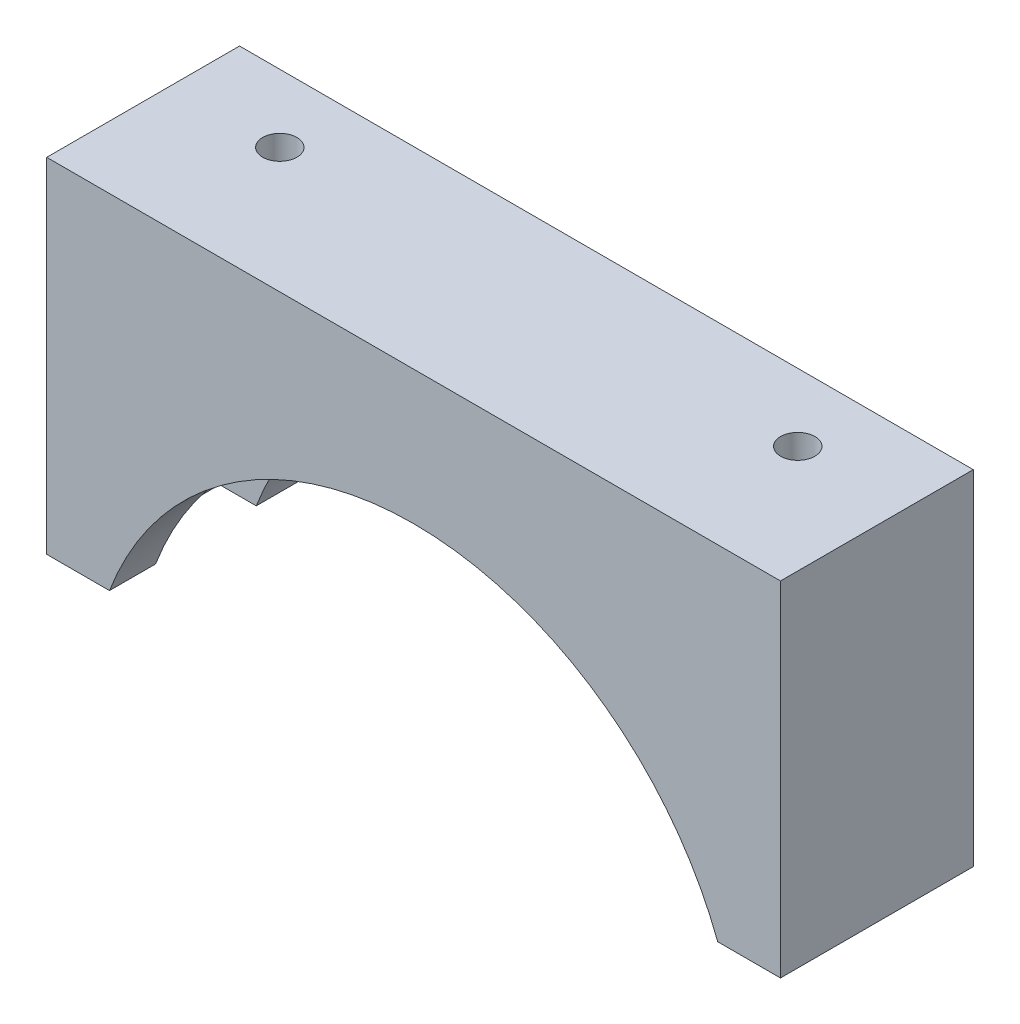
ISO-10303-21;
HEADER;
FILE_DESCRIPTION(('STEP AP214'),'2;1');
FILE_NAME('part.step','',(''),(''),'','','');
FILE_SCHEMA(('AUTOMOTIVE_DESIGN { 1 0 10303 214 1 1 1 1 }'));
ENDSEC;
DATA;
#1=APPLICATION_CONTEXT('core data for automotive mechanical design processes');
#2=APPLICATION_PROTOCOL_DEFINITION('international standard','automotive_design',2000,#1);
#3=PRODUCT_CONTEXT('',#1,'mechanical');
#4=PRODUCT('Part','Part','',(#3));
#5=PRODUCT_RELATED_PRODUCT_CATEGORY('part','',(#4));
#6=PRODUCT_DEFINITION_FORMATION('','',#4);
#7=PRODUCT_DEFINITION_CONTEXT('part definition',#1,'design');
#8=PRODUCT_DEFINITION('design','',#6,#7);
#9=PRODUCT_DEFINITION_SHAPE('','',#8);
#10=(LENGTH_UNIT() NAMED_UNIT(*) SI_UNIT(.MILLI.,.METRE.));
#11=(NAMED_UNIT(*) PLANE_ANGLE_UNIT() SI_UNIT($,.RADIAN.));
#12=(NAMED_UNIT(*) SI_UNIT($,.STERADIAN.) SOLID_ANGLE_UNIT());
#13=UNCERTAINTY_MEASURE_WITH_UNIT(LENGTH_MEASURE(1.E-05),#10,'distance_accuracy_value','');
#14=(GEOMETRIC_REPRESENTATION_CONTEXT(3) GLOBAL_UNCERTAINTY_ASSIGNED_CONTEXT((#13)) GLOBAL_UNIT_ASSIGNED_CONTEXT((#10,
#11,#12)) REPRESENTATION_CONTEXT('',''));
#15=CARTESIAN_POINT('',(0.,0.,0.));
#16=DIRECTION('',(0.,0.,1.));
#17=DIRECTION('',(1.,0.,0.));
#18=AXIS2_PLACEMENT_3D('',#15,#16,#17);
#19=CARTESIAN_POINT('',(0.,0.,3.3502));
#20=DIRECTION('',(0.,0.,-1.));
#21=DIRECTION('',(-1.,0.,0.));
#22=AXIS2_PLACEMENT_3D('',#19,#20,#21);
#23=CYLINDRICAL_SURFACE('',#22,11.3);
#24=CARTESIAN_POINT('',(0.,0.,-3.3502));
#25=DIRECTION('',(0.,0.,-1.));
#26=DIRECTION('',(-1.,0.,0.));
#27=AXIS2_PLACEMENT_3D('',#24,#25,#26);
#28=CIRCLE('',#27,11.3);
#29=CARTESIAN_POINT('',(-10.5683489722851,4.,-3.3502));
#30=VERTEX_POINT('',#29);
#31=CARTESIAN_POINT('',(10.5683489722851,4.,-3.3502));
#32=VERTEX_POINT('',#31);
#33=EDGE_CURVE('E202',#30,#32,#28,.T.);
#34=ORIENTED_EDGE('',*,*,#33,.T.);
#35=DIRECTION('',(0.,0.,-1.));
#36=VECTOR('',#35,1.);
#37=CARTESIAN_POINT('',(10.5683489722851,4.,3.3502));
#38=LINE('',#37,#36);
#39=CARTESIAN_POINT('',(10.5683489722851,4.,-1.75));
#40=VERTEX_POINT('',#39);
#41=EDGE_CURVE('E166',#32,#40,#38,.F.);
#42=ORIENTED_EDGE('',*,*,#41,.T.);
#43=CARTESIAN_POINT('',(0.,0.,-1.75));
#44=DIRECTION('',(0.,0.,-1.));
#45=DIRECTION('',(-1.,0.,0.));
#46=AXIS2_PLACEMENT_3D('',#43,#44,#45);
#47=CIRCLE('',#46,11.3);
#48=CARTESIAN_POINT('',(-10.5683489722851,4.,-1.75));
#49=VERTEX_POINT('',#48);
#50=EDGE_CURVE('E194',#49,#40,#47,.T.);
#51=ORIENTED_EDGE('',*,*,#50,.F.);
#52=DIRECTION('',(0.,0.,-1.));
#53=VECTOR('',#52,1.);
#54=CARTESIAN_POINT('',(-10.5683489722851,4.,3.35020000000001));
#55=LINE('',#54,#53);
#56=EDGE_CURVE('E182',#49,#30,#55,.T.);
#57=ORIENTED_EDGE('',*,*,#56,.T.);
#58=EDGE_LOOP('',(#34,#42,#51,#57));
#59=FACE_BOUND('',#58,.T.);
#60=ADVANCED_FACE('F41',(#59),#23,.F.);
#61=CARTESIAN_POINT('',(0.,0.,1.75));
#62=DIRECTION('',(0.,0.,-1.));
#63=DIRECTION('',(-1.,0.,0.));
#64=AXIS2_PLACEMENT_3D('',#61,#62,#63);
#65=CIRCLE('',#64,11.3);
#66=CARTESIAN_POINT('',(-10.5683489722851,4.,1.75));
#67=VERTEX_POINT('',#66);
#68=CARTESIAN_POINT('',(10.5683489722851,4.,1.75));
#69=VERTEX_POINT('',#68);
#70=EDGE_CURVE('E190',#67,#69,#65,.T.);
#71=ORIENTED_EDGE('',*,*,#70,.T.);
#72=DIRECTION('',(0.,0.,-1.));
#73=VECTOR('',#72,1.);
#74=CARTESIAN_POINT('',(10.5683489722851,4.,3.3502));
#75=LINE('',#74,#73);
#76=CARTESIAN_POINT('',(10.5683489722851,4.,3.3502));
#77=VERTEX_POINT('',#76);
#78=EDGE_CURVE('E64',#69,#77,#75,.F.);
#79=ORIENTED_EDGE('',*,*,#78,.T.);
#80=CARTESIAN_POINT('',(0.,0.,3.3502));
#81=DIRECTION('',(0.,0.,-1.));
#82=DIRECTION('',(-1.,0.,0.));
#83=AXIS2_PLACEMENT_3D('',#80,#81,#82);
#84=CIRCLE('',#83,11.3);
#85=CARTESIAN_POINT('',(-10.5683489722851,4.,3.3502));
#86=VERTEX_POINT('',#85);
#87=EDGE_CURVE('E203',#86,#77,#84,.T.);
#88=ORIENTED_EDGE('',*,*,#87,.F.);
#89=DIRECTION('',(0.,0.,-1.));
#90=VECTOR('',#89,1.);
#91=CARTESIAN_POINT('',(-10.5683489722851,4.,3.35020000000001));
#92=LINE('',#91,#90);
#93=EDGE_CURVE('E178',#86,#67,#92,.T.);
#94=ORIENTED_EDGE('',*,*,#93,.T.);
#95=EDGE_LOOP('',(#71,#79,#88,#94));
#96=FACE_BOUND('',#95,.T.);
#97=ADVANCED_FACE('F254',(#96),#23,.F.);
#98=CARTESIAN_POINT('',(-12.75,15.95,0.));
#99=DIRECTION('',(-1.,0.,0.));
#100=DIRECTION('',(0.,0.,1.));
#101=AXIS2_PLACEMENT_3D('',#98,#99,#100);
#102=PLANE('',#101);
#103=DIRECTION('',(0.,0.,1.));
#104=VECTOR('',#103,1.);
#105=CARTESIAN_POINT('',(-12.75,4.,-9.6498));
#106=LINE('',#105,#104);
#107=CARTESIAN_POINT('',(-12.75,4.,-3.3502));
#108=VERTEX_POINT('',#107);
#109=CARTESIAN_POINT('',(-12.75,4.,3.3502));
#110=VERTEX_POINT('',#109);
#111=EDGE_CURVE('E152',#108,#110,#106,.T.);
#112=ORIENTED_EDGE('',*,*,#111,.T.);
#113=DIRECTION('',(0.,-1.,0.));
#114=VECTOR('',#113,1.);
#115=CARTESIAN_POINT('',(-12.75,15.95,3.3502));
#116=LINE('',#115,#114);
#117=CARTESIAN_POINT('',(-12.75,15.95,3.3502));
#118=VERTEX_POINT('',#117);
#119=EDGE_CURVE('E234',#118,#110,#116,.T.);
#120=ORIENTED_EDGE('',*,*,#119,.F.);
#121=DIRECTION('',(0.,0.,-1.));
#122=VECTOR('',#121,1.);
#123=CARTESIAN_POINT('',(-12.75,15.95,0.));
#124=LINE('',#123,#122);
#125=CARTESIAN_POINT('',(-12.75,15.95,-3.3502));
#126=VERTEX_POINT('',#125);
#127=EDGE_CURVE('E207',#118,#126,#124,.T.);
#128=ORIENTED_EDGE('',*,*,#127,.T.);
#129=DIRECTION('',(0.,-1.,0.));
#130=VECTOR('',#129,1.);
#131=CARTESIAN_POINT('',(-12.75,15.95,-3.3502));
#132=LINE('',#131,#130);
#133=EDGE_CURVE('E223',#126,#108,#132,.T.);
#134=ORIENTED_EDGE('',*,*,#133,.T.);
#135=EDGE_LOOP('',(#112,#120,#128,#134));
#136=FACE_BOUND('',#135,.T.);
#137=ADVANCED_FACE('F43',(#136),#102,.T.);
#138=CARTESIAN_POINT('',(0.,15.95,3.3502));
#139=DIRECTION('',(0.,0.,-1.));
#140=DIRECTION('',(-1.,0.,0.));
#141=AXIS2_PLACEMENT_3D('',#138,#139,#140);
#142=PLANE('',#141);
#143=ORIENTED_EDGE('',*,*,#119,.T.);
#144=DIRECTION('',(-1.,0.,0.));
#145=VECTOR('',#144,1.);
#146=CARTESIAN_POINT('',(-12.75,4.,3.3502));
#147=LINE('',#146,#145);
#148=EDGE_CURVE('E147',#86,#110,#147,.T.);
#149=ORIENTED_EDGE('',*,*,#148,.F.);
#150=ORIENTED_EDGE('',*,*,#87,.T.);
#151=CARTESIAN_POINT('',(12.75,4.,3.3502));
#152=VERTEX_POINT('',#151);
#153=EDGE_CURVE('E148',#152,#77,#147,.T.);
#154=ORIENTED_EDGE('',*,*,#153,.F.);
#155=DIRECTION('',(0.,-1.,0.));
#156=VECTOR('',#155,1.);
#157=CARTESIAN_POINT('',(12.75,15.95,3.3502));
#158=LINE('',#157,#156);
#159=CARTESIAN_POINT('',(12.75,15.95,3.3502));
#160=VERTEX_POINT('',#159);
#161=EDGE_CURVE('E231',#160,#152,#158,.T.);
#162=ORIENTED_EDGE('',*,*,#161,.F.);
#163=DIRECTION('',(1.,0.,0.));
#164=VECTOR('',#163,1.);
#165=CARTESIAN_POINT('',(0.,15.95,3.3502));
#166=LINE('',#165,#164);
#167=EDGE_CURVE('E214',#118,#160,#166,.T.);
#168=ORIENTED_EDGE('',*,*,#167,.F.);
#169=EDGE_LOOP('',(#143,#149,#150,#154,#162,#168));
#170=FACE_BOUND('',#169,.T.);
#171=ADVANCED_FACE('F256',(#170),#142,.F.);
#172=CARTESIAN_POINT('',(12.75,15.95,0.));
#173=DIRECTION('',(-1.,0.,0.));
#174=DIRECTION('',(0.,0.,1.));
#175=AXIS2_PLACEMENT_3D('',#172,#173,#174);
#176=PLANE('',#175);
#177=ORIENTED_EDGE('',*,*,#161,.T.);
#178=DIRECTION('',(0.,0.,1.));
#179=VECTOR('',#178,1.);
#180=CARTESIAN_POINT('',(12.75,4.,-9.6498));
#181=LINE('',#180,#179);
#182=CARTESIAN_POINT('',(12.75,4.,-3.3502));
#183=VERTEX_POINT('',#182);
#184=EDGE_CURVE('E151',#183,#152,#181,.T.);
#185=ORIENTED_EDGE('',*,*,#184,.F.);
#186=DIRECTION('',(0.,-1.,0.));
#187=VECTOR('',#186,1.);
#188=CARTESIAN_POINT('',(12.75,15.95,-3.3502));
#189=LINE('',#188,#187);
#190=CARTESIAN_POINT('',(12.75,15.95,-3.3502));
#191=VERTEX_POINT('',#190);
#192=EDGE_CURVE('E227',#191,#183,#189,.T.);
#193=ORIENTED_EDGE('',*,*,#192,.F.);
#194=DIRECTION('',(0.,0.,-1.));
#195=VECTOR('',#194,1.);
#196=CARTESIAN_POINT('',(12.75,15.95,0.));
#197=LINE('',#196,#195);
#198=EDGE_CURVE('E217',#160,#191,#197,.T.);
#199=ORIENTED_EDGE('',*,*,#198,.F.);
#200=EDGE_LOOP('',(#177,#185,#193,#199));
#201=FACE_BOUND('',#200,.T.);
#202=ADVANCED_FACE('F275',(#201),#176,.F.);
#203=CARTESIAN_POINT('',(0.,15.95,-3.3502));
#204=DIRECTION('',(0.,0.,1.));
#205=DIRECTION('',(1.,0.,0.));
#206=AXIS2_PLACEMENT_3D('',#203,#204,#205);
#207=PLANE('',#206);
#208=ORIENTED_EDGE('',*,*,#192,.T.);
#209=DIRECTION('',(-1.,0.,0.));
#210=VECTOR('',#209,1.);
#211=CARTESIAN_POINT('',(0.,4.,-3.3502));
#212=LINE('',#211,#210);
#213=EDGE_CURVE('E171',#183,#32,#212,.T.);
#214=ORIENTED_EDGE('',*,*,#213,.T.);
#215=ORIENTED_EDGE('',*,*,#33,.F.);
#216=EDGE_CURVE('E175',#30,#108,#212,.T.);
#217=ORIENTED_EDGE('',*,*,#216,.T.);
#218=ORIENTED_EDGE('',*,*,#133,.F.);
#219=DIRECTION('',(-1.,0.,0.));
#220=VECTOR('',#219,1.);
#221=CARTESIAN_POINT('',(0.,15.95,-3.3502));
#222=LINE('',#221,#220);
#223=EDGE_CURVE('E220',#191,#126,#222,.T.);
#224=ORIENTED_EDGE('',*,*,#223,.F.);
#225=EDGE_LOOP('',(#208,#214,#215,#217,#218,#224));
#226=FACE_BOUND('',#225,.T.);
#227=ADVANCED_FACE('F265',(#226),#207,.F.);
#228=CARTESIAN_POINT('',(0.,15.95,0.));
#229=DIRECTION('',(0.,1.,0.));
#230=DIRECTION('',(0.,0.,1.));
#231=AXIS2_PLACEMENT_3D('',#228,#229,#230);
#232=PLANE('',#231);
#233=CARTESIAN_POINT('',(-9.,15.95,-1.));
#234=DIRECTION('',(0.,1.,0.));
#235=DIRECTION('',(0.,0.,1.));
#236=AXIS2_PLACEMENT_3D('',#233,#234,#235);
#237=CIRCLE('',#236,0.595629999999989);
#238=CARTESIAN_POINT('',(-9.,15.95,-0.404370000000011));
#239=VERTEX_POINT('',#238);
#240=EDGE_CURVE('E134',#239,#239,#237,.T.);
#241=ORIENTED_EDGE('',*,*,#240,.F.);
#242=EDGE_LOOP('',(#241));
#243=FACE_BOUND('',#242,.T.);
#244=CARTESIAN_POINT('',(9.,15.95,-1.));
#245=DIRECTION('',(0.,1.,0.));
#246=DIRECTION('',(0.,0.,1.));
#247=AXIS2_PLACEMENT_3D('',#244,#245,#246);
#248=CIRCLE('',#247,0.595629999999989);
#249=CARTESIAN_POINT('',(9.,15.95,-0.404370000000011));
#250=VERTEX_POINT('',#249);
#251=EDGE_CURVE('E133',#250,#250,#248,.T.);
#252=ORIENTED_EDGE('',*,*,#251,.F.);
#253=EDGE_LOOP('',(#252));
#254=FACE_BOUND('',#253,.T.);
#255=ORIENTED_EDGE('',*,*,#127,.F.);
#256=ORIENTED_EDGE('',*,*,#167,.T.);
#257=ORIENTED_EDGE('',*,*,#198,.T.);
#258=ORIENTED_EDGE('',*,*,#223,.T.);
#259=EDGE_LOOP('',(#255,#256,#257,#258));
#260=FACE_BOUND('',#259,.T.);
#261=ADVANCED_FACE('F270',(#243,#254,#260),#232,.T.);
#262=CARTESIAN_POINT('',(0.,0.,0.));
#263=DIRECTION('',(0.,0.,-1.));
#264=DIRECTION('',(-1.,0.,0.));
#265=AXIS2_PLACEMENT_3D('',#262,#263,#264);
#266=CYLINDRICAL_SURFACE('',#265,12.5);
#267=DIRECTION('',(0.,0.,-1.));
#268=VECTOR('',#267,1.);
#269=CARTESIAN_POINT('',(11.842719282327,4.,0.));
#270=LINE('',#269,#268);
#271=CARTESIAN_POINT('',(11.842719282327,4.,1.75));
#272=VERTEX_POINT('',#271);
#273=CARTESIAN_POINT('',(11.842719282327,4.,-1.75));
#274=VERTEX_POINT('',#273);
#275=EDGE_CURVE('E156',#272,#274,#270,.T.);
#276=ORIENTED_EDGE('',*,*,#275,.F.);
#277=CARTESIAN_POINT('',(0.,0.,1.75));
#278=DIRECTION('',(0.,0.,-1.));
#279=DIRECTION('',(-1.,0.,0.));
#280=AXIS2_PLACEMENT_3D('',#277,#278,#279);
#281=CIRCLE('',#280,12.5);
#282=CARTESIAN_POINT('',(-11.842719282327,4.,1.75));
#283=VERTEX_POINT('',#282);
#284=EDGE_CURVE('E186',#283,#272,#281,.T.);
#285=ORIENTED_EDGE('',*,*,#284,.F.);
#286=DIRECTION('',(0.,0.,-1.));
#287=VECTOR('',#286,1.);
#288=CARTESIAN_POINT('',(-11.842719282327,4.,0.));
#289=LINE('',#288,#287);
#290=CARTESIAN_POINT('',(-11.842719282327,4.,-1.75));
#291=VERTEX_POINT('',#290);
#292=EDGE_CURVE('E56',#291,#283,#289,.F.);
#293=ORIENTED_EDGE('',*,*,#292,.F.);
#294=CARTESIAN_POINT('',(0.,0.,-1.75));
#295=DIRECTION('',(0.,0.,-1.));
#296=DIRECTION('',(-1.,0.,0.));
#297=AXIS2_PLACEMENT_3D('',#294,#295,#296);
#298=CIRCLE('',#297,12.5);
#299=EDGE_CURVE('E198',#291,#274,#298,.T.);
#300=ORIENTED_EDGE('',*,*,#299,.T.);
#301=EDGE_LOOP('',(#276,#285,#293,#300));
#302=FACE_BOUND('',#301,.T.);
#303=ADVANCED_FACE('F248',(#302),#266,.F.);
#304=CARTESIAN_POINT('',(-12.5,0.,-1.75));
#305=DIRECTION('',(0.,0.,1.));
#306=DIRECTION('',(1.,0.,0.));
#307=AXIS2_PLACEMENT_3D('',#304,#305,#306);
#308=PLANE('',#307);
#309=DIRECTION('',(-1.,0.,0.));
#310=VECTOR('',#309,1.);
#311=CARTESIAN_POINT('',(-12.5,4.,-1.75));
#312=LINE('',#311,#310);
#313=EDGE_CURVE('E163',#274,#40,#312,.T.);
#314=ORIENTED_EDGE('',*,*,#313,.F.);
#315=ORIENTED_EDGE('',*,*,#299,.F.);
#316=EDGE_CURVE('E167',#49,#291,#312,.T.);
#317=ORIENTED_EDGE('',*,*,#316,.F.);
#318=ORIENTED_EDGE('',*,*,#50,.T.);
#319=EDGE_LOOP('',(#314,#315,#317,#318));
#320=FACE_BOUND('',#319,.T.);
#321=ADVANCED_FACE('F280',(#320),#308,.T.);
#322=CARTESIAN_POINT('',(-12.5,0.,1.75));
#323=DIRECTION('',(0.,0.,-1.));
#324=DIRECTION('',(-1.,0.,0.));
#325=AXIS2_PLACEMENT_3D('',#322,#323,#324);
#326=PLANE('',#325);
#327=DIRECTION('',(1.,0.,0.));
#328=VECTOR('',#327,1.);
#329=CARTESIAN_POINT('',(-12.5,4.,1.75));
#330=LINE('',#329,#328);
#331=EDGE_CURVE('E11',#283,#67,#330,.T.);
#332=ORIENTED_EDGE('',*,*,#331,.F.);
#333=ORIENTED_EDGE('',*,*,#284,.T.);
#334=EDGE_CURVE('E45',#69,#272,#330,.T.);
#335=ORIENTED_EDGE('',*,*,#334,.F.);
#336=ORIENTED_EDGE('',*,*,#70,.F.);
#337=EDGE_LOOP('',(#332,#333,#335,#336));
#338=FACE_BOUND('',#337,.T.);
#339=ADVANCED_FACE('F250',(#338),#326,.T.);
#340=CARTESIAN_POINT('',(-12.75,4.,-9.6498));
#341=DIRECTION('',(0.,1.,0.));
#342=DIRECTION('',(0.,0.,1.));
#343=AXIS2_PLACEMENT_3D('',#340,#341,#342);
#344=PLANE('',#343);
#345=ORIENTED_EDGE('',*,*,#184,.T.);
#346=ORIENTED_EDGE('',*,*,#153,.T.);
#347=ORIENTED_EDGE('',*,*,#78,.F.);
#348=ORIENTED_EDGE('',*,*,#334,.T.);
#349=ORIENTED_EDGE('',*,*,#275,.T.);
#350=ORIENTED_EDGE('',*,*,#313,.T.);
#351=ORIENTED_EDGE('',*,*,#41,.F.);
#352=ORIENTED_EDGE('',*,*,#213,.F.);
#353=EDGE_LOOP('',(#345,#346,#347,#348,#349,#350,#351,#352));
#354=FACE_BOUND('',#353,.T.);
#355=ADVANCED_FACE('F242',(#354),#344,.F.);
#356=ORIENTED_EDGE('',*,*,#56,.F.);
#357=ORIENTED_EDGE('',*,*,#316,.T.);
#358=ORIENTED_EDGE('',*,*,#292,.T.);
#359=ORIENTED_EDGE('',*,*,#331,.T.);
#360=ORIENTED_EDGE('',*,*,#93,.F.);
#361=ORIENTED_EDGE('',*,*,#148,.T.);
#362=ORIENTED_EDGE('',*,*,#111,.F.);
#363=ORIENTED_EDGE('',*,*,#216,.F.);
#364=EDGE_LOOP('',(#356,#357,#358,#359,#360,#361,#362,#363));
#365=FACE_BOUND('',#364,.T.);
#366=ADVANCED_FACE('F251',(#365),#344,.F.);
#367=CARTESIAN_POINT('',(9.,12.95,-1.));
#368=DIRECTION('',(0.,1.,0.));
#369=DIRECTION('',(0.,0.,1.));
#370=AXIS2_PLACEMENT_3D('',#367,#368,#369);
#371=CONICAL_SURFACE('',#370,0.595629999999988,1.02974425867665);
#372=CARTESIAN_POINT('',(9.,12.5921093894886,-1.));
#373=VERTEX_POINT('',#372);
#374=VERTEX_LOOP('',#373);
#375=FACE_BOUND('',#374,.T.);
#376=CARTESIAN_POINT('',(9.,12.95,-1.));
#377=DIRECTION('',(0.,1.,0.));
#378=DIRECTION('',(0.,0.,1.));
#379=AXIS2_PLACEMENT_3D('',#376,#377,#378);
#380=CIRCLE('',#379,0.595629999999988);
#381=CARTESIAN_POINT('',(9.,12.95,-0.404370000000012));
#382=VERTEX_POINT('',#381);
#383=EDGE_CURVE('E139',#382,#382,#380,.T.);
#384=ORIENTED_EDGE('',*,*,#383,.T.);
#385=EDGE_LOOP('',(#384));
#386=FACE_BOUND('',#385,.T.);
#387=ADVANCED_FACE('F348',(#375,#386),#371,.F.);
#388=CARTESIAN_POINT('',(9.,15.95,-1.));
#389=DIRECTION('',(0.,1.,0.));
#390=DIRECTION('',(0.,0.,1.));
#391=AXIS2_PLACEMENT_3D('',#388,#389,#390);
#392=CYLINDRICAL_SURFACE('',#391,0.595629999999988);
#393=ORIENTED_EDGE('',*,*,#383,.F.);
#394=EDGE_LOOP('',(#393));
#395=FACE_BOUND('',#394,.T.);
#396=ORIENTED_EDGE('',*,*,#251,.T.);
#397=EDGE_LOOP('',(#396));
#398=FACE_BOUND('',#397,.T.);
#399=ADVANCED_FACE('F126',(#395,#398),#392,.F.);
#400=CARTESIAN_POINT('',(-9.,12.95,-1.));
#401=DIRECTION('',(0.,1.,0.));
#402=DIRECTION('',(0.,0.,1.));
#403=AXIS2_PLACEMENT_3D('',#400,#401,#402);
#404=CONICAL_SURFACE('',#403,0.595629999999988,1.02974425867665);
#405=CARTESIAN_POINT('',(-9.,12.5921093894886,-1.));
#406=VERTEX_POINT('',#405);
#407=VERTEX_LOOP('',#406);
#408=FACE_BOUND('',#407,.T.);
#409=CARTESIAN_POINT('',(-9.,12.95,-1.));
#410=DIRECTION('',(0.,1.,0.));
#411=DIRECTION('',(0.,0.,1.));
#412=AXIS2_PLACEMENT_3D('',#409,#410,#411);
#413=CIRCLE('',#412,0.595629999999988);
#414=CARTESIAN_POINT('',(-9.,12.95,-0.404370000000012));
#415=VERTEX_POINT('',#414);
#416=EDGE_CURVE('E130',#415,#415,#413,.T.);
#417=ORIENTED_EDGE('',*,*,#416,.T.);
#418=EDGE_LOOP('',(#417));
#419=FACE_BOUND('',#418,.T.);
#420=ADVANCED_FACE('F122',(#408,#419),#404,.F.);
#421=CARTESIAN_POINT('',(-9.,15.95,-1.));
#422=DIRECTION('',(0.,1.,0.));
#423=DIRECTION('',(0.,0.,1.));
#424=AXIS2_PLACEMENT_3D('',#421,#422,#423);
#425=CYLINDRICAL_SURFACE('',#424,0.595629999999988);
#426=ORIENTED_EDGE('',*,*,#416,.F.);
#427=EDGE_LOOP('',(#426));
#428=FACE_BOUND('',#427,.T.);
#429=ORIENTED_EDGE('',*,*,#240,.T.);
#430=EDGE_LOOP('',(#429));
#431=FACE_BOUND('',#430,.T.);
#432=ADVANCED_FACE('F125',(#428,#431),#425,.F.);
#433=CLOSED_SHELL('',(#60,#97,#137,#171,#202,#227,#261,#303,#321,#339,#355,#366,#387,#399,#420,#432));
#434=MANIFOLD_SOLID_BREP('B2',#433);
#435=ADVANCED_BREP_SHAPE_REPRESENTATION('',(#18,#434),#14);
#436=SHAPE_DEFINITION_REPRESENTATION(#9,#435);
ENDSEC;
END-ISO-10303-21;
